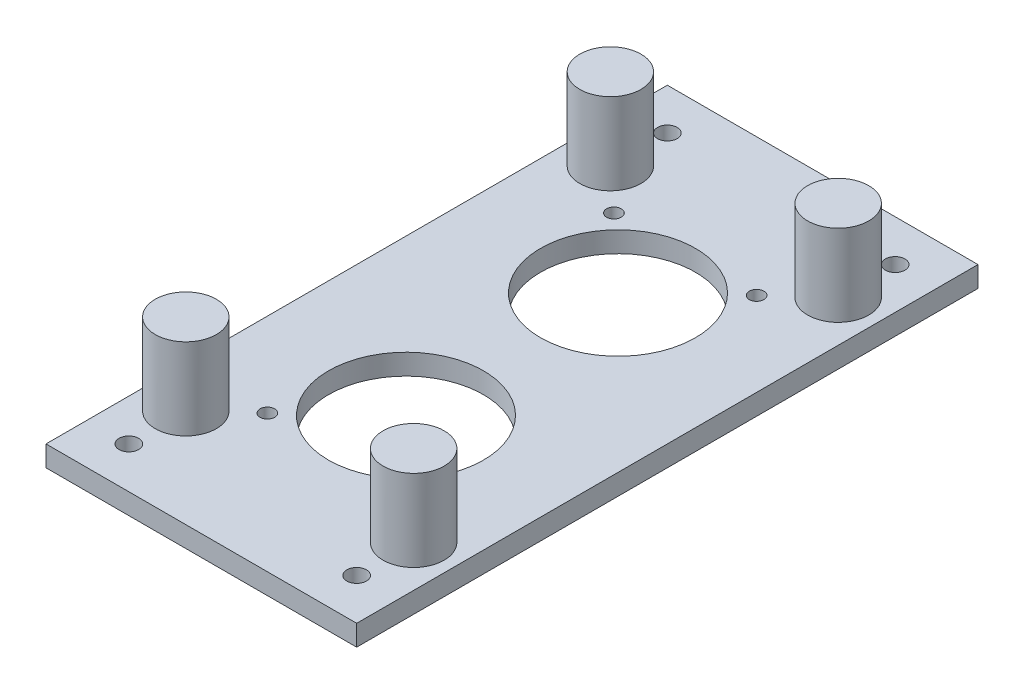
ISO-10303-21;
HEADER;
FILE_DESCRIPTION(('STEP AP214'),'2;1');
FILE_NAME('part.step','',(''),(''),'','','');
FILE_SCHEMA(('AUTOMOTIVE_DESIGN { 1 0 10303 214 1 1 1 1 }'));
ENDSEC;
DATA;
#1=APPLICATION_CONTEXT('core data for automotive mechanical design processes');
#2=APPLICATION_PROTOCOL_DEFINITION('international standard','automotive_design',2000,#1);
#3=PRODUCT_CONTEXT('',#1,'mechanical');
#4=PRODUCT('Part','Part','',(#3));
#5=PRODUCT_RELATED_PRODUCT_CATEGORY('part','',(#4));
#6=PRODUCT_DEFINITION_FORMATION('','',#4);
#7=PRODUCT_DEFINITION_CONTEXT('part definition',#1,'design');
#8=PRODUCT_DEFINITION('design','',#6,#7);
#9=PRODUCT_DEFINITION_SHAPE('','',#8);
#10=(LENGTH_UNIT() NAMED_UNIT(*) SI_UNIT(.MILLI.,.METRE.));
#11=(NAMED_UNIT(*) PLANE_ANGLE_UNIT() SI_UNIT($,.RADIAN.));
#12=(NAMED_UNIT(*) SI_UNIT($,.STERADIAN.) SOLID_ANGLE_UNIT());
#13=UNCERTAINTY_MEASURE_WITH_UNIT(LENGTH_MEASURE(1.E-05),#10,'distance_accuracy_value','');
#14=(GEOMETRIC_REPRESENTATION_CONTEXT(3) GLOBAL_UNCERTAINTY_ASSIGNED_CONTEXT((#13)) GLOBAL_UNIT_ASSIGNED_CONTEXT((#10,
#11,#12)) REPRESENTATION_CONTEXT('',''));
#15=CARTESIAN_POINT('',(0.,0.,0.));
#16=DIRECTION('',(0.,0.,1.));
#17=DIRECTION('',(1.,0.,0.));
#18=AXIS2_PLACEMENT_3D('',#15,#16,#17);
#19=CARTESIAN_POINT('',(19.05,2.54,38.1));
#20=DIRECTION('',(-1.,0.,0.));
#21=DIRECTION('',(0.,0.,1.));
#22=AXIS2_PLACEMENT_3D('',#19,#20,#21);
#23=PLANE('',#22);
#24=DIRECTION('',(0.,0.,-1.));
#25=VECTOR('',#24,1.);
#26=CARTESIAN_POINT('',(19.05,0.,38.1));
#27=LINE('',#26,#25);
#28=CARTESIAN_POINT('',(19.05,0.,38.1));
#29=VERTEX_POINT('',#28);
#30=CARTESIAN_POINT('',(19.05,0.,-38.1));
#31=VERTEX_POINT('',#30);
#32=EDGE_CURVE('E106',#29,#31,#27,.T.);
#33=ORIENTED_EDGE('',*,*,#32,.T.);
#34=DIRECTION('',(0.,-1.,0.));
#35=VECTOR('',#34,1.);
#36=CARTESIAN_POINT('',(19.05,2.54,-38.1));
#37=LINE('',#36,#35);
#38=CARTESIAN_POINT('',(19.05,2.54,-38.1));
#39=VERTEX_POINT('',#38);
#40=EDGE_CURVE('E97',#39,#31,#37,.T.);
#41=ORIENTED_EDGE('',*,*,#40,.F.);
#42=DIRECTION('',(0.,0.,-1.));
#43=VECTOR('',#42,1.);
#44=CARTESIAN_POINT('',(19.05,2.54,38.1));
#45=LINE('',#44,#43);
#46=CARTESIAN_POINT('',(19.05,2.54,38.1));
#47=VERTEX_POINT('',#46);
#48=EDGE_CURVE('E91',#47,#39,#45,.T.);
#49=ORIENTED_EDGE('',*,*,#48,.F.);
#50=DIRECTION('',(0.,-1.,0.));
#51=VECTOR('',#50,1.);
#52=CARTESIAN_POINT('',(19.05,2.54,38.1));
#53=LINE('',#52,#51);
#54=EDGE_CURVE('E102',#47,#29,#53,.T.);
#55=ORIENTED_EDGE('',*,*,#54,.T.);
#56=EDGE_LOOP('',(#33,#41,#49,#55));
#57=FACE_BOUND('',#56,.T.);
#58=ADVANCED_FACE('F39',(#57),#23,.F.);
#59=CARTESIAN_POINT('',(-19.05,2.54,-38.1));
#60=DIRECTION('',(0.,0.,1.));
#61=DIRECTION('',(1.,0.,0.));
#62=AXIS2_PLACEMENT_3D('',#59,#60,#61);
#63=PLANE('',#62);
#64=DIRECTION('',(-1.,0.,0.));
#65=VECTOR('',#64,1.);
#66=CARTESIAN_POINT('',(-19.05,0.,-38.1));
#67=LINE('',#66,#65);
#68=CARTESIAN_POINT('',(-19.05,0.,-38.1));
#69=VERTEX_POINT('',#68);
#70=EDGE_CURVE('E96',#31,#69,#67,.T.);
#71=ORIENTED_EDGE('',*,*,#70,.T.);
#72=DIRECTION('',(0.,-1.,0.));
#73=VECTOR('',#72,1.);
#74=CARTESIAN_POINT('',(-19.05,2.54,-38.1));
#75=LINE('',#74,#73);
#76=CARTESIAN_POINT('',(-19.05,2.54,-38.1));
#77=VERTEX_POINT('',#76);
#78=EDGE_CURVE('E94',#77,#69,#75,.T.);
#79=ORIENTED_EDGE('',*,*,#78,.F.);
#80=DIRECTION('',(-1.,0.,0.));
#81=VECTOR('',#80,1.);
#82=CARTESIAN_POINT('',(-19.05,2.54,-38.1));
#83=LINE('',#82,#81);
#84=EDGE_CURVE('E86',#39,#77,#83,.T.);
#85=ORIENTED_EDGE('',*,*,#84,.F.);
#86=ORIENTED_EDGE('',*,*,#40,.T.);
#87=EDGE_LOOP('',(#71,#79,#85,#86));
#88=FACE_BOUND('',#87,.T.);
#89=ADVANCED_FACE('F95',(#88),#63,.F.);
#90=CARTESIAN_POINT('',(-19.05,2.54,38.1));
#91=DIRECTION('',(1.,0.,0.));
#92=DIRECTION('',(0.,0.,-1.));
#93=AXIS2_PLACEMENT_3D('',#90,#91,#92);
#94=PLANE('',#93);
#95=DIRECTION('',(0.,0.,1.));
#96=VECTOR('',#95,1.);
#97=CARTESIAN_POINT('',(-19.05,0.,38.1));
#98=LINE('',#97,#96);
#99=CARTESIAN_POINT('',(-19.05,0.,38.1));
#100=VERTEX_POINT('',#99);
#101=EDGE_CURVE('E72',#69,#100,#98,.T.);
#102=ORIENTED_EDGE('',*,*,#101,.T.);
#103=DIRECTION('',(0.,-1.,0.));
#104=VECTOR('',#103,1.);
#105=CARTESIAN_POINT('',(-19.05,2.54,38.1));
#106=LINE('',#105,#104);
#107=CARTESIAN_POINT('',(-19.05,2.54,38.1));
#108=VERTEX_POINT('',#107);
#109=EDGE_CURVE('E98',#108,#100,#106,.T.);
#110=ORIENTED_EDGE('',*,*,#109,.F.);
#111=DIRECTION('',(0.,0.,1.));
#112=VECTOR('',#111,1.);
#113=CARTESIAN_POINT('',(-19.05,2.54,38.1));
#114=LINE('',#113,#112);
#115=EDGE_CURVE('E89',#77,#108,#114,.T.);
#116=ORIENTED_EDGE('',*,*,#115,.F.);
#117=ORIENTED_EDGE('',*,*,#78,.T.);
#118=EDGE_LOOP('',(#102,#110,#116,#117));
#119=FACE_BOUND('',#118,.T.);
#120=ADVANCED_FACE('F100',(#119),#94,.F.);
#121=CARTESIAN_POINT('',(-19.05,2.54,38.1));
#122=DIRECTION('',(0.,0.,-1.));
#123=DIRECTION('',(-1.,0.,0.));
#124=AXIS2_PLACEMENT_3D('',#121,#122,#123);
#125=PLANE('',#124);
#126=DIRECTION('',(1.,0.,0.));
#127=VECTOR('',#126,1.);
#128=CARTESIAN_POINT('',(-19.05,0.,38.1));
#129=LINE('',#128,#127);
#130=EDGE_CURVE('E78',#100,#29,#129,.T.);
#131=ORIENTED_EDGE('',*,*,#130,.T.);
#132=ORIENTED_EDGE('',*,*,#54,.F.);
#133=DIRECTION('',(1.,0.,0.));
#134=VECTOR('',#133,1.);
#135=CARTESIAN_POINT('',(-19.05,2.54,38.1));
#136=LINE('',#135,#134);
#137=EDGE_CURVE('E55',#108,#47,#136,.T.);
#138=ORIENTED_EDGE('',*,*,#137,.F.);
#139=ORIENTED_EDGE('',*,*,#109,.T.);
#140=EDGE_LOOP('',(#131,#132,#138,#139));
#141=FACE_BOUND('',#140,.T.);
#142=ADVANCED_FACE('F123',(#141),#125,.F.);
#143=CARTESIAN_POINT('',(0.,2.54,0.));
#144=DIRECTION('',(0.,-1.,0.));
#145=DIRECTION('',(0.,0.,-1.));
#146=AXIS2_PLACEMENT_3D('',#143,#144,#145);
#147=PLANE('',#146);
#148=CARTESIAN_POINT('',(13.97,2.54,-26.035));
#149=DIRECTION('',(0.,-1.,0.));
#150=DIRECTION('',(0.,0.,-1.));
#151=AXIS2_PLACEMENT_3D('',#148,#149,#150);
#152=CIRCLE('',#151,3.749999993);
#153=CARTESIAN_POINT('',(13.97,2.54,-29.784999993));
#154=VERTEX_POINT('',#153);
#155=EDGE_CURVE('E219',#154,#154,#152,.T.);
#156=ORIENTED_EDGE('',*,*,#155,.T.);
#157=EDGE_LOOP('',(#156));
#158=FACE_BOUND('',#157,.T.);
#159=CARTESIAN_POINT('',(-13.97,2.54,-26.035));
#160=DIRECTION('',(0.,-1.,0.));
#161=DIRECTION('',(0.,0.,-1.));
#162=AXIS2_PLACEMENT_3D('',#159,#160,#161);
#163=CIRCLE('',#162,3.749999993);
#164=CARTESIAN_POINT('',(-13.97,2.54,-29.784999993));
#165=VERTEX_POINT('',#164);
#166=EDGE_CURVE('E213',#165,#165,#163,.T.);
#167=ORIENTED_EDGE('',*,*,#166,.T.);
#168=EDGE_LOOP('',(#167));
#169=FACE_BOUND('',#168,.T.);
#170=CARTESIAN_POINT('',(13.97,2.54,26.035));
#171=DIRECTION('',(0.,-1.,0.));
#172=DIRECTION('',(0.,0.,-1.));
#173=AXIS2_PLACEMENT_3D('',#170,#171,#172);
#174=CIRCLE('',#173,3.749999993);
#175=CARTESIAN_POINT('',(13.97,2.54,22.285000007));
#176=VERTEX_POINT('',#175);
#177=EDGE_CURVE('E11',#176,#176,#174,.F.);
#178=ORIENTED_EDGE('',*,*,#177,.F.);
#179=EDGE_LOOP('',(#178));
#180=FACE_BOUND('',#179,.T.);
#181=CARTESIAN_POINT('',(-13.97,2.54,26.035));
#182=DIRECTION('',(0.,-1.,0.));
#183=DIRECTION('',(0.,0.,-1.));
#184=AXIS2_PLACEMENT_3D('',#181,#182,#183);
#185=CIRCLE('',#184,3.749999993);
#186=CARTESIAN_POINT('',(-13.97,2.54,22.285000007));
#187=VERTEX_POINT('',#186);
#188=EDGE_CURVE('E47',#187,#187,#185,.F.);
#189=ORIENTED_EDGE('',*,*,#188,.F.);
#190=EDGE_LOOP('',(#189));
#191=FACE_BOUND('',#190,.T.);
#192=CARTESIAN_POINT('',(-13.97,2.54,-33.02));
#193=DIRECTION('',(0.,1.,0.));
#194=DIRECTION('',(0.,0.,1.));
#195=AXIS2_PLACEMENT_3D('',#192,#193,#194);
#196=CIRCLE('',#195,1.19999999999999);
#197=CARTESIAN_POINT('',(-13.97,2.54,-31.82));
#198=VERTEX_POINT('',#197);
#199=EDGE_CURVE('E129',#198,#198,#196,.T.);
#200=ORIENTED_EDGE('',*,*,#199,.F.);
#201=EDGE_LOOP('',(#200));
#202=FACE_BOUND('',#201,.T.);
#203=CARTESIAN_POINT('',(13.97,2.54,-33.02));
#204=DIRECTION('',(0.,1.,0.));
#205=DIRECTION('',(0.,0.,1.));
#206=AXIS2_PLACEMENT_3D('',#203,#204,#205);
#207=CIRCLE('',#206,1.19999999999999);
#208=CARTESIAN_POINT('',(13.97,2.54,-31.82));
#209=VERTEX_POINT('',#208);
#210=EDGE_CURVE('E133',#209,#209,#207,.T.);
#211=ORIENTED_EDGE('',*,*,#210,.F.);
#212=EDGE_LOOP('',(#211));
#213=FACE_BOUND('',#212,.T.);
#214=CARTESIAN_POINT('',(-13.97,2.54,33.02));
#215=DIRECTION('',(0.,1.,0.));
#216=DIRECTION('',(0.,0.,1.));
#217=AXIS2_PLACEMENT_3D('',#214,#215,#216);
#218=CIRCLE('',#217,1.19999999999999);
#219=CARTESIAN_POINT('',(-13.97,2.54,34.22));
#220=VERTEX_POINT('',#219);
#221=EDGE_CURVE('E137',#220,#220,#218,.T.);
#222=ORIENTED_EDGE('',*,*,#221,.F.);
#223=EDGE_LOOP('',(#222));
#224=FACE_BOUND('',#223,.T.);
#225=CARTESIAN_POINT('',(13.97,2.54,33.02));
#226=DIRECTION('',(0.,1.,0.));
#227=DIRECTION('',(0.,0.,1.));
#228=AXIS2_PLACEMENT_3D('',#225,#226,#227);
#229=CIRCLE('',#228,1.19999999999999);
#230=CARTESIAN_POINT('',(13.97,2.54,34.22));
#231=VERTEX_POINT('',#230);
#232=EDGE_CURVE('E141',#231,#231,#229,.T.);
#233=ORIENTED_EDGE('',*,*,#232,.F.);
#234=EDGE_LOOP('',(#233));
#235=FACE_BOUND('',#234,.T.);
#236=CARTESIAN_POINT('',(8.750000026,2.54,-21.250000045));
#237=DIRECTION('',(0.,1.,0.));
#238=DIRECTION('',(0.,0.,1.));
#239=AXIS2_PLACEMENT_3D('',#236,#237,#238);
#240=CIRCLE('',#239,0.9);
#241=CARTESIAN_POINT('',(8.750000026,2.54,-20.350000045));
#242=VERTEX_POINT('',#241);
#243=EDGE_CURVE('E145',#242,#242,#240,.T.);
#244=ORIENTED_EDGE('',*,*,#243,.F.);
#245=EDGE_LOOP('',(#244));
#246=FACE_BOUND('',#245,.T.);
#247=CARTESIAN_POINT('',(8.750000026,2.54,21.250000045));
#248=DIRECTION('',(0.,1.,0.));
#249=DIRECTION('',(0.,0.,1.));
#250=AXIS2_PLACEMENT_3D('',#247,#248,#249);
#251=CIRCLE('',#250,0.9);
#252=CARTESIAN_POINT('',(8.750000026,2.54,22.150000045));
#253=VERTEX_POINT('',#252);
#254=EDGE_CURVE('E149',#253,#253,#251,.T.);
#255=ORIENTED_EDGE('',*,*,#254,.F.);
#256=EDGE_LOOP('',(#255));
#257=FACE_BOUND('',#256,.T.);
#258=CARTESIAN_POINT('',(-8.750000026,2.54,21.250000045));
#259=DIRECTION('',(0.,1.,0.));
#260=DIRECTION('',(0.,0.,1.));
#261=AXIS2_PLACEMENT_3D('',#258,#259,#260);
#262=CIRCLE('',#261,0.9);
#263=CARTESIAN_POINT('',(-8.750000026,2.54,22.150000045));
#264=VERTEX_POINT('',#263);
#265=EDGE_CURVE('E153',#264,#264,#262,.T.);
#266=ORIENTED_EDGE('',*,*,#265,.F.);
#267=EDGE_LOOP('',(#266));
#268=FACE_BOUND('',#267,.T.);
#269=CARTESIAN_POINT('',(-8.750000026,2.54,-21.250000045));
#270=DIRECTION('',(0.,1.,0.));
#271=DIRECTION('',(0.,0.,1.));
#272=AXIS2_PLACEMENT_3D('',#269,#270,#271);
#273=CIRCLE('',#272,0.9);
#274=CARTESIAN_POINT('',(-8.750000026,2.54,-20.350000045));
#275=VERTEX_POINT('',#274);
#276=EDGE_CURVE('E157',#275,#275,#273,.T.);
#277=ORIENTED_EDGE('',*,*,#276,.F.);
#278=EDGE_LOOP('',(#277));
#279=FACE_BOUND('',#278,.T.);
#280=CARTESIAN_POINT('',(0.,2.54,13.000000035));
#281=DIRECTION('',(0.,1.,0.));
#282=DIRECTION('',(0.,0.,1.));
#283=AXIS2_PLACEMENT_3D('',#280,#281,#282);
#284=CIRCLE('',#283,9.5);
#285=CARTESIAN_POINT('',(0.,2.54,22.500000035));
#286=VERTEX_POINT('',#285);
#287=EDGE_CURVE('E161',#286,#286,#284,.T.);
#288=ORIENTED_EDGE('',*,*,#287,.F.);
#289=EDGE_LOOP('',(#288));
#290=FACE_BOUND('',#289,.T.);
#291=CARTESIAN_POINT('',(0.,2.54,-13.000000035));
#292=DIRECTION('',(0.,1.,0.));
#293=DIRECTION('',(0.,0.,1.));
#294=AXIS2_PLACEMENT_3D('',#291,#292,#293);
#295=CIRCLE('',#294,9.5);
#296=CARTESIAN_POINT('',(0.,2.54,-3.500000035));
#297=VERTEX_POINT('',#296);
#298=EDGE_CURVE('E164',#297,#297,#295,.T.);
#299=ORIENTED_EDGE('',*,*,#298,.F.);
#300=EDGE_LOOP('',(#299));
#301=FACE_BOUND('',#300,.T.);
#302=ORIENTED_EDGE('',*,*,#48,.T.);
#303=ORIENTED_EDGE('',*,*,#84,.T.);
#304=ORIENTED_EDGE('',*,*,#115,.T.);
#305=ORIENTED_EDGE('',*,*,#137,.T.);
#306=EDGE_LOOP('',(#302,#303,#304,#305));
#307=FACE_BOUND('',#306,.T.);
#308=ADVANCED_FACE('F87',(#158,#169,#180,#191,#202,#213,#224,#235,#246,#257,#268,#279,#290,#301,
#307),#147,.F.);
#309=CARTESIAN_POINT('',(0.,0.,0.));
#310=DIRECTION('',(0.,-1.,0.));
#311=DIRECTION('',(0.,0.,-1.));
#312=AXIS2_PLACEMENT_3D('',#309,#310,#311);
#313=PLANE('',#312);
#314=CARTESIAN_POINT('',(-13.97,0.,-33.02));
#315=DIRECTION('',(0.,1.,0.));
#316=DIRECTION('',(0.,0.,1.));
#317=AXIS2_PLACEMENT_3D('',#314,#315,#316);
#318=CIRCLE('',#317,1.19999999999999);
#319=CARTESIAN_POINT('',(-13.97,0.,-31.82));
#320=VERTEX_POINT('',#319);
#321=EDGE_CURVE('E202',#320,#320,#318,.T.);
#322=ORIENTED_EDGE('',*,*,#321,.T.);
#323=EDGE_LOOP('',(#322));
#324=FACE_BOUND('',#323,.T.);
#325=CARTESIAN_POINT('',(13.97,0.,-33.02));
#326=DIRECTION('',(0.,1.,0.));
#327=DIRECTION('',(0.,0.,1.));
#328=AXIS2_PLACEMENT_3D('',#325,#326,#327);
#329=CIRCLE('',#328,1.19999999999999);
#330=CARTESIAN_POINT('',(13.97,0.,-31.82));
#331=VERTEX_POINT('',#330);
#332=EDGE_CURVE('E198',#331,#331,#329,.T.);
#333=ORIENTED_EDGE('',*,*,#332,.T.);
#334=EDGE_LOOP('',(#333));
#335=FACE_BOUND('',#334,.T.);
#336=CARTESIAN_POINT('',(-13.97,0.,33.02));
#337=DIRECTION('',(0.,1.,0.));
#338=DIRECTION('',(0.,0.,1.));
#339=AXIS2_PLACEMENT_3D('',#336,#337,#338);
#340=CIRCLE('',#339,1.19999999999999);
#341=CARTESIAN_POINT('',(-13.97,0.,34.22));
#342=VERTEX_POINT('',#341);
#343=EDGE_CURVE('E194',#342,#342,#340,.T.);
#344=ORIENTED_EDGE('',*,*,#343,.T.);
#345=EDGE_LOOP('',(#344));
#346=FACE_BOUND('',#345,.T.);
#347=CARTESIAN_POINT('',(13.97,0.,33.02));
#348=DIRECTION('',(0.,1.,0.));
#349=DIRECTION('',(0.,0.,1.));
#350=AXIS2_PLACEMENT_3D('',#347,#348,#349);
#351=CIRCLE('',#350,1.19999999999999);
#352=CARTESIAN_POINT('',(13.97,0.,34.22));
#353=VERTEX_POINT('',#352);
#354=EDGE_CURVE('E190',#353,#353,#351,.T.);
#355=ORIENTED_EDGE('',*,*,#354,.T.);
#356=EDGE_LOOP('',(#355));
#357=FACE_BOUND('',#356,.T.);
#358=CARTESIAN_POINT('',(8.750000026,0.,-21.250000045));
#359=DIRECTION('',(0.,1.,0.));
#360=DIRECTION('',(0.,0.,1.));
#361=AXIS2_PLACEMENT_3D('',#358,#359,#360);
#362=CIRCLE('',#361,0.9);
#363=CARTESIAN_POINT('',(8.750000026,0.,-20.350000045));
#364=VERTEX_POINT('',#363);
#365=EDGE_CURVE('E186',#364,#364,#362,.T.);
#366=ORIENTED_EDGE('',*,*,#365,.T.);
#367=EDGE_LOOP('',(#366));
#368=FACE_BOUND('',#367,.T.);
#369=CARTESIAN_POINT('',(8.750000026,0.,21.250000045));
#370=DIRECTION('',(0.,1.,0.));
#371=DIRECTION('',(0.,0.,1.));
#372=AXIS2_PLACEMENT_3D('',#369,#370,#371);
#373=CIRCLE('',#372,0.9);
#374=CARTESIAN_POINT('',(8.750000026,0.,22.150000045));
#375=VERTEX_POINT('',#374);
#376=EDGE_CURVE('E182',#375,#375,#373,.T.);
#377=ORIENTED_EDGE('',*,*,#376,.T.);
#378=EDGE_LOOP('',(#377));
#379=FACE_BOUND('',#378,.T.);
#380=CARTESIAN_POINT('',(-8.750000026,0.,21.250000045));
#381=DIRECTION('',(0.,1.,0.));
#382=DIRECTION('',(0.,0.,1.));
#383=AXIS2_PLACEMENT_3D('',#380,#381,#382);
#384=CIRCLE('',#383,0.9);
#385=CARTESIAN_POINT('',(-8.750000026,0.,22.150000045));
#386=VERTEX_POINT('',#385);
#387=EDGE_CURVE('E178',#386,#386,#384,.T.);
#388=ORIENTED_EDGE('',*,*,#387,.T.);
#389=EDGE_LOOP('',(#388));
#390=FACE_BOUND('',#389,.T.);
#391=CARTESIAN_POINT('',(-8.750000026,0.,-21.250000045));
#392=DIRECTION('',(0.,1.,0.));
#393=DIRECTION('',(0.,0.,1.));
#394=AXIS2_PLACEMENT_3D('',#391,#392,#393);
#395=CIRCLE('',#394,0.9);
#396=CARTESIAN_POINT('',(-8.750000026,0.,-20.350000045));
#397=VERTEX_POINT('',#396);
#398=EDGE_CURVE('E174',#397,#397,#395,.T.);
#399=ORIENTED_EDGE('',*,*,#398,.T.);
#400=EDGE_LOOP('',(#399));
#401=FACE_BOUND('',#400,.T.);
#402=CARTESIAN_POINT('',(0.,0.,13.000000035));
#403=DIRECTION('',(0.,1.,0.));
#404=DIRECTION('',(0.,0.,1.));
#405=AXIS2_PLACEMENT_3D('',#402,#403,#404);
#406=CIRCLE('',#405,9.5);
#407=CARTESIAN_POINT('',(0.,0.,22.500000035));
#408=VERTEX_POINT('',#407);
#409=EDGE_CURVE('E166',#408,#408,#406,.T.);
#410=ORIENTED_EDGE('',*,*,#409,.T.);
#411=EDGE_LOOP('',(#410));
#412=FACE_BOUND('',#411,.T.);
#413=CARTESIAN_POINT('',(0.,0.,-13.000000035));
#414=DIRECTION('',(0.,1.,0.));
#415=DIRECTION('',(0.,0.,1.));
#416=AXIS2_PLACEMENT_3D('',#413,#414,#415);
#417=CIRCLE('',#416,9.5);
#418=CARTESIAN_POINT('',(0.,0.,-3.500000035));
#419=VERTEX_POINT('',#418);
#420=EDGE_CURVE('E109',#419,#419,#417,.T.);
#421=ORIENTED_EDGE('',*,*,#420,.T.);
#422=EDGE_LOOP('',(#421));
#423=FACE_BOUND('',#422,.T.);
#424=ORIENTED_EDGE('',*,*,#32,.F.);
#425=ORIENTED_EDGE('',*,*,#130,.F.);
#426=ORIENTED_EDGE('',*,*,#101,.F.);
#427=ORIENTED_EDGE('',*,*,#70,.F.);
#428=EDGE_LOOP('',(#424,#425,#426,#427));
#429=FACE_BOUND('',#428,.T.);
#430=ADVANCED_FACE('F122',(#324,#335,#346,#357,#368,#379,#390,#401,#412,#423,#429),#313,.T.);
#431=CARTESIAN_POINT('',(0.,2.54,-13.000000035));
#432=DIRECTION('',(0.,1.,0.));
#433=DIRECTION('',(0.,0.,1.));
#434=AXIS2_PLACEMENT_3D('',#431,#432,#433);
#435=CYLINDRICAL_SURFACE('',#434,9.5);
#436=ORIENTED_EDGE('',*,*,#420,.F.);
#437=EDGE_LOOP('',(#436));
#438=FACE_BOUND('',#437,.T.);
#439=ORIENTED_EDGE('',*,*,#298,.T.);
#440=EDGE_LOOP('',(#439));
#441=FACE_BOUND('',#440,.T.);
#442=ADVANCED_FACE('F244',(#438,#441),#435,.F.);
#443=CARTESIAN_POINT('',(0.,2.54,13.000000035));
#444=DIRECTION('',(0.,1.,0.));
#445=DIRECTION('',(0.,0.,1.));
#446=AXIS2_PLACEMENT_3D('',#443,#444,#445);
#447=CYLINDRICAL_SURFACE('',#446,9.5);
#448=ORIENTED_EDGE('',*,*,#409,.F.);
#449=EDGE_LOOP('',(#448));
#450=FACE_BOUND('',#449,.T.);
#451=ORIENTED_EDGE('',*,*,#287,.T.);
#452=EDGE_LOOP('',(#451));
#453=FACE_BOUND('',#452,.T.);
#454=ADVANCED_FACE('F250',(#450,#453),#447,.F.);
#455=CARTESIAN_POINT('',(-8.750000026,2.54,-21.250000045));
#456=DIRECTION('',(0.,1.,0.));
#457=DIRECTION('',(0.,0.,1.));
#458=AXIS2_PLACEMENT_3D('',#455,#456,#457);
#459=CYLINDRICAL_SURFACE('',#458,0.9);
#460=ORIENTED_EDGE('',*,*,#398,.F.);
#461=EDGE_LOOP('',(#460));
#462=FACE_BOUND('',#461,.T.);
#463=ORIENTED_EDGE('',*,*,#276,.T.);
#464=EDGE_LOOP('',(#463));
#465=FACE_BOUND('',#464,.T.);
#466=ADVANCED_FACE('F353',(#462,#465),#459,.F.);
#467=CARTESIAN_POINT('',(-8.750000026,2.54,21.250000045));
#468=DIRECTION('',(0.,1.,0.));
#469=DIRECTION('',(0.,0.,1.));
#470=AXIS2_PLACEMENT_3D('',#467,#468,#469);
#471=CYLINDRICAL_SURFACE('',#470,0.9);
#472=ORIENTED_EDGE('',*,*,#387,.F.);
#473=EDGE_LOOP('',(#472));
#474=FACE_BOUND('',#473,.T.);
#475=ORIENTED_EDGE('',*,*,#265,.T.);
#476=EDGE_LOOP('',(#475));
#477=FACE_BOUND('',#476,.T.);
#478=ADVANCED_FACE('F349',(#474,#477),#471,.F.);
#479=CARTESIAN_POINT('',(8.750000026,2.54,21.250000045));
#480=DIRECTION('',(0.,1.,0.));
#481=DIRECTION('',(0.,0.,1.));
#482=AXIS2_PLACEMENT_3D('',#479,#480,#481);
#483=CYLINDRICAL_SURFACE('',#482,0.9);
#484=ORIENTED_EDGE('',*,*,#376,.F.);
#485=EDGE_LOOP('',(#484));
#486=FACE_BOUND('',#485,.T.);
#487=ORIENTED_EDGE('',*,*,#254,.T.);
#488=EDGE_LOOP('',(#487));
#489=FACE_BOUND('',#488,.T.);
#490=ADVANCED_FACE('F345',(#486,#489),#483,.F.);
#491=CARTESIAN_POINT('',(8.750000026,2.54,-21.250000045));
#492=DIRECTION('',(0.,1.,0.));
#493=DIRECTION('',(0.,0.,1.));
#494=AXIS2_PLACEMENT_3D('',#491,#492,#493);
#495=CYLINDRICAL_SURFACE('',#494,0.9);
#496=ORIENTED_EDGE('',*,*,#365,.F.);
#497=EDGE_LOOP('',(#496));
#498=FACE_BOUND('',#497,.T.);
#499=ORIENTED_EDGE('',*,*,#243,.T.);
#500=EDGE_LOOP('',(#499));
#501=FACE_BOUND('',#500,.T.);
#502=ADVANCED_FACE('F341',(#498,#501),#495,.F.);
#503=CARTESIAN_POINT('',(13.97,2.54,33.02));
#504=DIRECTION('',(0.,1.,0.));
#505=DIRECTION('',(0.,0.,1.));
#506=AXIS2_PLACEMENT_3D('',#503,#504,#505);
#507=CYLINDRICAL_SURFACE('',#506,1.19999999999999);
#508=ORIENTED_EDGE('',*,*,#354,.F.);
#509=EDGE_LOOP('',(#508));
#510=FACE_BOUND('',#509,.T.);
#511=ORIENTED_EDGE('',*,*,#232,.T.);
#512=EDGE_LOOP('',(#511));
#513=FACE_BOUND('',#512,.T.);
#514=ADVANCED_FACE('F337',(#510,#513),#507,.F.);
#515=CARTESIAN_POINT('',(-13.97,2.54,33.02));
#516=DIRECTION('',(0.,1.,0.));
#517=DIRECTION('',(0.,0.,1.));
#518=AXIS2_PLACEMENT_3D('',#515,#516,#517);
#519=CYLINDRICAL_SURFACE('',#518,1.19999999999999);
#520=ORIENTED_EDGE('',*,*,#343,.F.);
#521=EDGE_LOOP('',(#520));
#522=FACE_BOUND('',#521,.T.);
#523=ORIENTED_EDGE('',*,*,#221,.T.);
#524=EDGE_LOOP('',(#523));
#525=FACE_BOUND('',#524,.T.);
#526=ADVANCED_FACE('F333',(#522,#525),#519,.F.);
#527=CARTESIAN_POINT('',(13.97,2.54,-33.02));
#528=DIRECTION('',(0.,1.,0.));
#529=DIRECTION('',(0.,0.,1.));
#530=AXIS2_PLACEMENT_3D('',#527,#528,#529);
#531=CYLINDRICAL_SURFACE('',#530,1.19999999999999);
#532=ORIENTED_EDGE('',*,*,#332,.F.);
#533=EDGE_LOOP('',(#532));
#534=FACE_BOUND('',#533,.T.);
#535=ORIENTED_EDGE('',*,*,#210,.T.);
#536=EDGE_LOOP('',(#535));
#537=FACE_BOUND('',#536,.T.);
#538=ADVANCED_FACE('F329',(#534,#537),#531,.F.);
#539=CARTESIAN_POINT('',(-13.97,2.54,-33.02));
#540=DIRECTION('',(0.,1.,0.));
#541=DIRECTION('',(0.,0.,1.));
#542=AXIS2_PLACEMENT_3D('',#539,#540,#541);
#543=CYLINDRICAL_SURFACE('',#542,1.19999999999999);
#544=ORIENTED_EDGE('',*,*,#321,.F.);
#545=EDGE_LOOP('',(#544));
#546=FACE_BOUND('',#545,.T.);
#547=ORIENTED_EDGE('',*,*,#199,.T.);
#548=EDGE_LOOP('',(#547));
#549=FACE_BOUND('',#548,.T.);
#550=ADVANCED_FACE('F325',(#546,#549),#543,.F.);
#551=CARTESIAN_POINT('',(-13.97,12.540000066,26.035));
#552=DIRECTION('',(0.,-1.,0.));
#553=DIRECTION('',(0.,0.,-1.));
#554=AXIS2_PLACEMENT_3D('',#551,#552,#553);
#555=CYLINDRICAL_SURFACE('',#554,3.749999993);
#556=CARTESIAN_POINT('',(-13.97,12.540000066,26.035));
#557=DIRECTION('',(0.,1.,0.));
#558=DIRECTION('',(0.,0.,1.));
#559=AXIS2_PLACEMENT_3D('',#556,#557,#558);
#560=CIRCLE('',#559,3.749999993);
#561=CARTESIAN_POINT('',(-13.97,12.540000066,29.784999993));
#562=VERTEX_POINT('',#561);
#563=EDGE_CURVE('E206',#562,#562,#560,.T.);
#564=ORIENTED_EDGE('',*,*,#563,.F.);
#565=EDGE_LOOP('',(#564));
#566=FACE_BOUND('',#565,.T.);
#567=ORIENTED_EDGE('',*,*,#188,.T.);
#568=EDGE_LOOP('',(#567));
#569=FACE_BOUND('',#568,.T.);
#570=ADVANCED_FACE('F118',(#566,#569),#555,.T.);
#571=CARTESIAN_POINT('',(-13.97,12.540000066,26.035));
#572=DIRECTION('',(0.,1.,0.));
#573=DIRECTION('',(0.,0.,1.));
#574=AXIS2_PLACEMENT_3D('',#571,#572,#573);
#575=PLANE('',#574);
#576=ORIENTED_EDGE('',*,*,#563,.T.);
#577=EDGE_LOOP('',(#576));
#578=FACE_BOUND('',#577,.T.);
#579=ADVANCED_FACE('F318',(#578),#575,.T.);
#580=CARTESIAN_POINT('',(13.97,12.540000066,26.035));
#581=DIRECTION('',(0.,-1.,0.));
#582=DIRECTION('',(0.,0.,-1.));
#583=AXIS2_PLACEMENT_3D('',#580,#581,#582);
#584=CYLINDRICAL_SURFACE('',#583,3.749999993);
#585=CARTESIAN_POINT('',(13.97,12.540000066,26.035));
#586=DIRECTION('',(0.,1.,0.));
#587=DIRECTION('',(0.,0.,1.));
#588=AXIS2_PLACEMENT_3D('',#585,#586,#587);
#589=CIRCLE('',#588,3.749999993);
#590=CARTESIAN_POINT('',(13.97,12.540000066,29.784999993));
#591=VERTEX_POINT('',#590);
#592=EDGE_CURVE('E209',#591,#591,#589,.T.);
#593=ORIENTED_EDGE('',*,*,#592,.F.);
#594=EDGE_LOOP('',(#593));
#595=FACE_BOUND('',#594,.T.);
#596=ORIENTED_EDGE('',*,*,#177,.T.);
#597=EDGE_LOOP('',(#596));
#598=FACE_BOUND('',#597,.T.);
#599=ADVANCED_FACE('F314',(#595,#598),#584,.T.);
#600=CARTESIAN_POINT('',(13.97,12.540000066,26.035));
#601=DIRECTION('',(0.,1.,0.));
#602=DIRECTION('',(0.,0.,1.));
#603=AXIS2_PLACEMENT_3D('',#600,#601,#602);
#604=PLANE('',#603);
#605=ORIENTED_EDGE('',*,*,#592,.T.);
#606=EDGE_LOOP('',(#605));
#607=FACE_BOUND('',#606,.T.);
#608=ADVANCED_FACE('F278',(#607),#604,.T.);
#609=CARTESIAN_POINT('',(-13.97,12.540000066,-26.035));
#610=DIRECTION('',(0.,-1.,0.));
#611=DIRECTION('',(0.,0.,-1.));
#612=AXIS2_PLACEMENT_3D('',#609,#610,#611);
#613=CYLINDRICAL_SURFACE('',#612,3.749999993);
#614=CARTESIAN_POINT('',(-13.97,12.540000066,-26.035));
#615=DIRECTION('',(0.,-1.,0.));
#616=DIRECTION('',(0.,0.,-1.));
#617=AXIS2_PLACEMENT_3D('',#614,#615,#616);
#618=CIRCLE('',#617,3.749999993);
#619=CARTESIAN_POINT('',(-13.97,12.540000066,-29.784999993));
#620=VERTEX_POINT('',#619);
#621=EDGE_CURVE('E212',#620,#620,#618,.T.);
#622=ORIENTED_EDGE('',*,*,#621,.T.);
#623=EDGE_LOOP('',(#622));
#624=FACE_BOUND('',#623,.T.);
#625=ORIENTED_EDGE('',*,*,#166,.F.);
#626=EDGE_LOOP('',(#625));
#627=FACE_BOUND('',#626,.T.);
#628=ADVANCED_FACE('F283',(#624,#627),#613,.T.);
#629=CARTESIAN_POINT('',(-13.97,12.540000066,-26.035));
#630=DIRECTION('',(0.,1.,0.));
#631=DIRECTION('',(0.,0.,-1.));
#632=AXIS2_PLACEMENT_3D('',#629,#630,#631);
#633=PLANE('',#632);
#634=ORIENTED_EDGE('',*,*,#621,.F.);
#635=EDGE_LOOP('',(#634));
#636=FACE_BOUND('',#635,.T.);
#637=ADVANCED_FACE('F234',(#636),#633,.T.);
#638=CARTESIAN_POINT('',(13.97,12.540000066,-26.035));
#639=DIRECTION('',(0.,-1.,0.));
#640=DIRECTION('',(0.,0.,-1.));
#641=AXIS2_PLACEMENT_3D('',#638,#639,#640);
#642=CYLINDRICAL_SURFACE('',#641,3.749999993);
#643=CARTESIAN_POINT('',(13.97,12.540000066,-26.035));
#644=DIRECTION('',(0.,-1.,0.));
#645=DIRECTION('',(0.,0.,-1.));
#646=AXIS2_PLACEMENT_3D('',#643,#644,#645);
#647=CIRCLE('',#646,3.749999993);
#648=CARTESIAN_POINT('',(13.97,12.540000066,-29.784999993));
#649=VERTEX_POINT('',#648);
#650=EDGE_CURVE('E216',#649,#649,#647,.T.);
#651=ORIENTED_EDGE('',*,*,#650,.T.);
#652=EDGE_LOOP('',(#651));
#653=FACE_BOUND('',#652,.T.);
#654=ORIENTED_EDGE('',*,*,#155,.F.);
#655=EDGE_LOOP('',(#654));
#656=FACE_BOUND('',#655,.T.);
#657=ADVANCED_FACE('F225',(#653,#656),#642,.T.);
#658=CARTESIAN_POINT('',(13.97,12.540000066,-26.035));
#659=DIRECTION('',(0.,1.,0.));
#660=DIRECTION('',(0.,0.,-1.));
#661=AXIS2_PLACEMENT_3D('',#658,#659,#660);
#662=PLANE('',#661);
#663=ORIENTED_EDGE('',*,*,#650,.F.);
#664=EDGE_LOOP('',(#663));
#665=FACE_BOUND('',#664,.T.);
#666=ADVANCED_FACE('F228',(#665),#662,.T.);
#667=CLOSED_SHELL('',(#58,#89,#120,#142,#308,#430,#442,#454,#466,#478,#490,#502,#514,#526,#538,
#550,#570,#579,#599,#608,#628,#637,#657,#666));
#668=MANIFOLD_SOLID_BREP('B2',#667);
#669=ADVANCED_BREP_SHAPE_REPRESENTATION('',(#18,#668),#14);
#670=SHAPE_DEFINITION_REPRESENTATION(#9,#669);
ENDSEC;
END-ISO-10303-21;
